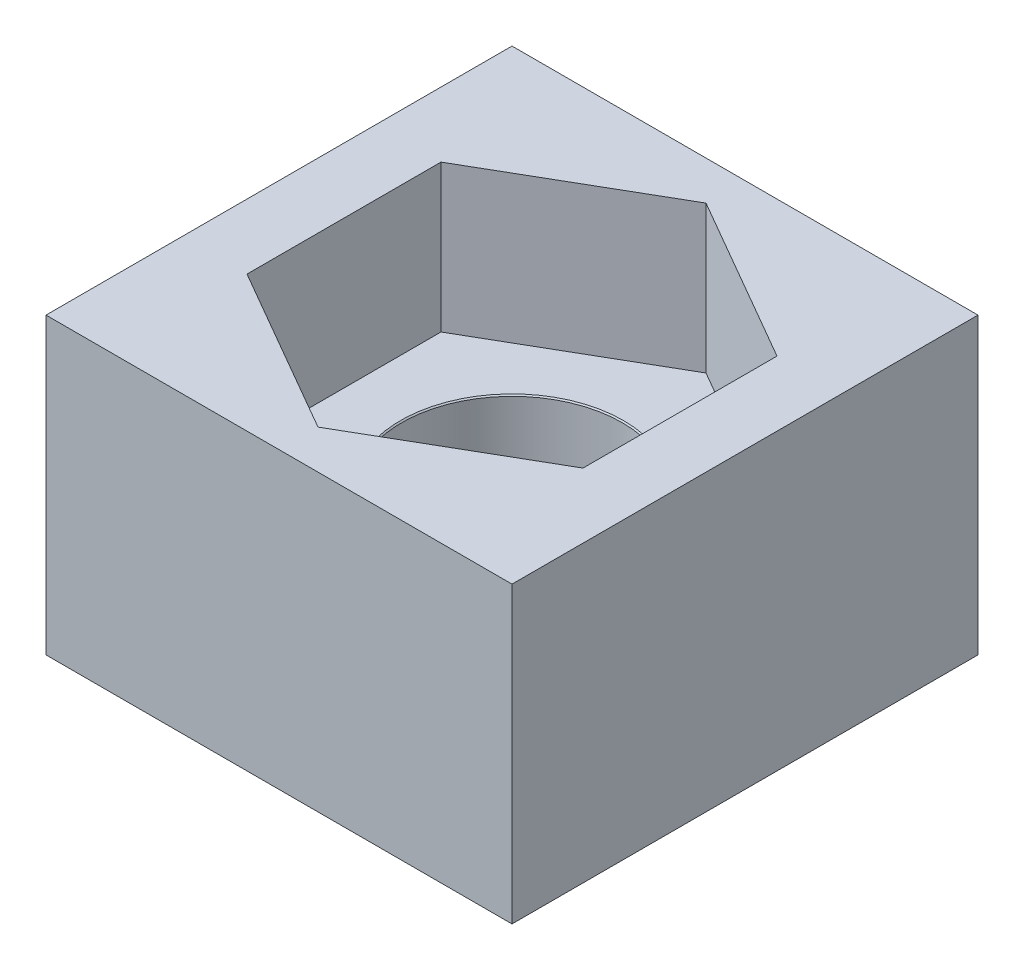
ISO-10303-21;
HEADER;
FILE_DESCRIPTION(('STEP AP214'),'2;1');
FILE_NAME('part.step','',(''),(''),'','','');
FILE_SCHEMA(('AUTOMOTIVE_DESIGN { 1 0 10303 214 1 1 1 1 }'));
ENDSEC;
DATA;
#1=APPLICATION_CONTEXT('core data for automotive mechanical design processes');
#2=APPLICATION_PROTOCOL_DEFINITION('international standard','automotive_design',2000,#1);
#3=PRODUCT_CONTEXT('',#1,'mechanical');
#4=PRODUCT('Part','Part','',(#3));
#5=PRODUCT_RELATED_PRODUCT_CATEGORY('part','',(#4));
#6=PRODUCT_DEFINITION_FORMATION('','',#4);
#7=PRODUCT_DEFINITION_CONTEXT('part definition',#1,'design');
#8=PRODUCT_DEFINITION('design','',#6,#7);
#9=PRODUCT_DEFINITION_SHAPE('','',#8);
#10=(LENGTH_UNIT() NAMED_UNIT(*) SI_UNIT(.MILLI.,.METRE.));
#11=(NAMED_UNIT(*) PLANE_ANGLE_UNIT() SI_UNIT($,.RADIAN.));
#12=(NAMED_UNIT(*) SI_UNIT($,.STERADIAN.) SOLID_ANGLE_UNIT());
#13=UNCERTAINTY_MEASURE_WITH_UNIT(LENGTH_MEASURE(1.E-05),#10,'distance_accuracy_value','');
#14=(GEOMETRIC_REPRESENTATION_CONTEXT(3) GLOBAL_UNCERTAINTY_ASSIGNED_CONTEXT((#13)) GLOBAL_UNIT_ASSIGNED_CONTEXT((#10,
#11,#12)) REPRESENTATION_CONTEXT('',''));
#15=CARTESIAN_POINT('',(0.,0.,0.));
#16=DIRECTION('',(0.,0.,1.));
#17=DIRECTION('',(1.,0.,0.));
#18=AXIS2_PLACEMENT_3D('',#15,#16,#17);
#19=CARTESIAN_POINT('',(4.75,6.,-4.75));
#20=DIRECTION('',(0.,0.,1.));
#21=DIRECTION('',(1.,0.,0.));
#22=AXIS2_PLACEMENT_3D('',#19,#20,#21);
#23=PLANE('',#22);
#24=DIRECTION('',(-1.,0.,0.));
#25=VECTOR('',#24,1.);
#26=CARTESIAN_POINT('',(4.75,0.,-4.75));
#27=LINE('',#26,#25);
#28=CARTESIAN_POINT('',(4.75,0.,-4.75));
#29=VERTEX_POINT('',#28);
#30=CARTESIAN_POINT('',(-4.75,0.,-4.75));
#31=VERTEX_POINT('',#30);
#32=EDGE_CURVE('E188',#29,#31,#27,.T.);
#33=ORIENTED_EDGE('',*,*,#32,.T.);
#34=DIRECTION('',(0.,-1.,0.));
#35=VECTOR('',#34,1.);
#36=CARTESIAN_POINT('',(-4.75,6.,-4.75));
#37=LINE('',#36,#35);
#38=CARTESIAN_POINT('',(-4.75,6.,-4.75));
#39=VERTEX_POINT('',#38);
#40=EDGE_CURVE('E11',#39,#31,#37,.T.);
#41=ORIENTED_EDGE('',*,*,#40,.F.);
#42=DIRECTION('',(-1.,0.,0.));
#43=VECTOR('',#42,1.);
#44=CARTESIAN_POINT('',(4.75,6.,-4.75));
#45=LINE('',#44,#43);
#46=CARTESIAN_POINT('',(4.75,6.,-4.75));
#47=VERTEX_POINT('',#46);
#48=EDGE_CURVE('E200',#47,#39,#45,.T.);
#49=ORIENTED_EDGE('',*,*,#48,.F.);
#50=DIRECTION('',(0.,-1.,0.));
#51=VECTOR('',#50,1.);
#52=CARTESIAN_POINT('',(4.75,6.,-4.75));
#53=LINE('',#52,#51);
#54=EDGE_CURVE('E63',#47,#29,#53,.T.);
#55=ORIENTED_EDGE('',*,*,#54,.T.);
#56=EDGE_LOOP('',(#33,#41,#49,#55));
#57=FACE_BOUND('',#56,.T.);
#58=ADVANCED_FACE('F39',(#57),#23,.F.);
#59=CARTESIAN_POINT('',(-4.75,6.,-4.75));
#60=DIRECTION('',(1.,0.,0.));
#61=DIRECTION('',(0.,0.,-1.));
#62=AXIS2_PLACEMENT_3D('',#59,#60,#61);
#63=PLANE('',#62);
#64=DIRECTION('',(0.,0.,1.));
#65=VECTOR('',#64,1.);
#66=CARTESIAN_POINT('',(-4.75,0.,-4.75));
#67=LINE('',#66,#65);
#68=CARTESIAN_POINT('',(-4.75,0.,4.75));
#69=VERTEX_POINT('',#68);
#70=EDGE_CURVE('E215',#31,#69,#67,.T.);
#71=ORIENTED_EDGE('',*,*,#70,.T.);
#72=DIRECTION('',(0.,-1.,0.));
#73=VECTOR('',#72,1.);
#74=CARTESIAN_POINT('',(-4.75,6.,4.75));
#75=LINE('',#74,#73);
#76=CARTESIAN_POINT('',(-4.75,6.,4.75));
#77=VERTEX_POINT('',#76);
#78=EDGE_CURVE('E47',#77,#69,#75,.T.);
#79=ORIENTED_EDGE('',*,*,#78,.F.);
#80=DIRECTION('',(0.,0.,1.));
#81=VECTOR('',#80,1.);
#82=CARTESIAN_POINT('',(-4.75,6.,-4.75));
#83=LINE('',#82,#81);
#84=EDGE_CURVE('E89',#39,#77,#83,.T.);
#85=ORIENTED_EDGE('',*,*,#84,.F.);
#86=ORIENTED_EDGE('',*,*,#40,.T.);
#87=EDGE_LOOP('',(#71,#79,#85,#86));
#88=FACE_BOUND('',#87,.T.);
#89=ADVANCED_FACE('F235',(#88),#63,.F.);
#90=CARTESIAN_POINT('',(4.75,6.,4.75));
#91=DIRECTION('',(0.,0.,1.));
#92=DIRECTION('',(1.,0.,0.));
#93=AXIS2_PLACEMENT_3D('',#90,#91,#92);
#94=PLANE('',#93);
#95=DIRECTION('',(-1.,0.,0.));
#96=VECTOR('',#95,1.);
#97=CARTESIAN_POINT('',(4.75,0.,4.75));
#98=LINE('',#97,#96);
#99=CARTESIAN_POINT('',(4.75,0.,4.75));
#100=VERTEX_POINT('',#99);
#101=EDGE_CURVE('E219',#100,#69,#98,.T.);
#102=ORIENTED_EDGE('',*,*,#101,.F.);
#103=DIRECTION('',(0.,-1.,0.));
#104=VECTOR('',#103,1.);
#105=CARTESIAN_POINT('',(4.75,6.,4.75));
#106=LINE('',#105,#104);
#107=CARTESIAN_POINT('',(4.75,6.,4.75));
#108=VERTEX_POINT('',#107);
#109=EDGE_CURVE('E228',#108,#100,#106,.T.);
#110=ORIENTED_EDGE('',*,*,#109,.F.);
#111=DIRECTION('',(-1.,0.,0.));
#112=VECTOR('',#111,1.);
#113=CARTESIAN_POINT('',(4.75,6.,4.75));
#114=LINE('',#113,#112);
#115=EDGE_CURVE('E206',#108,#77,#114,.T.);
#116=ORIENTED_EDGE('',*,*,#115,.T.);
#117=ORIENTED_EDGE('',*,*,#78,.T.);
#118=EDGE_LOOP('',(#102,#110,#116,#117));
#119=FACE_BOUND('',#118,.T.);
#120=ADVANCED_FACE('F233',(#119),#94,.T.);
#121=CARTESIAN_POINT('',(4.75,6.,-4.75));
#122=DIRECTION('',(1.,0.,0.));
#123=DIRECTION('',(0.,0.,-1.));
#124=AXIS2_PLACEMENT_3D('',#121,#122,#123);
#125=PLANE('',#124);
#126=DIRECTION('',(0.,0.,1.));
#127=VECTOR('',#126,1.);
#128=CARTESIAN_POINT('',(4.75,0.,-4.75));
#129=LINE('',#128,#127);
#130=EDGE_CURVE('E203',#29,#100,#129,.T.);
#131=ORIENTED_EDGE('',*,*,#130,.F.);
#132=ORIENTED_EDGE('',*,*,#54,.F.);
#133=DIRECTION('',(0.,0.,1.));
#134=VECTOR('',#133,1.);
#135=CARTESIAN_POINT('',(4.75,6.,-4.75));
#136=LINE('',#135,#134);
#137=EDGE_CURVE('E210',#47,#108,#136,.T.);
#138=ORIENTED_EDGE('',*,*,#137,.T.);
#139=ORIENTED_EDGE('',*,*,#109,.T.);
#140=EDGE_LOOP('',(#131,#132,#138,#139));
#141=FACE_BOUND('',#140,.T.);
#142=ADVANCED_FACE('F239',(#141),#125,.T.);
#143=CARTESIAN_POINT('',(0.,6.,0.));
#144=DIRECTION('',(0.,1.,0.));
#145=DIRECTION('',(0.,0.,1.));
#146=AXIS2_PLACEMENT_3D('',#143,#144,#145);
#147=PLANE('',#146);
#148=DIRECTION('',(0.866025403784439,0.,0.5));
#149=VECTOR('',#148,1.);
#150=CARTESIAN_POINT('',(-3.425,6.,1.97742467197447));
#151=LINE('',#150,#149);
#152=CARTESIAN_POINT('',(-3.425,6.,1.97742467197447));
#153=VERTEX_POINT('',#152);
#154=CARTESIAN_POINT('',(0.,6.,3.95484934394894));
#155=VERTEX_POINT('',#154);
#156=EDGE_CURVE('E54',#153,#155,#151,.T.);
#157=ORIENTED_EDGE('',*,*,#156,.F.);
#158=DIRECTION('',(0.,0.,1.));
#159=VECTOR('',#158,1.);
#160=CARTESIAN_POINT('',(-3.425,6.,-1.97742467197447));
#161=LINE('',#160,#159);
#162=CARTESIAN_POINT('',(-3.425,6.,-1.97742467197447));
#163=VERTEX_POINT('',#162);
#164=EDGE_CURVE('E148',#163,#153,#161,.T.);
#165=ORIENTED_EDGE('',*,*,#164,.F.);
#166=DIRECTION('',(-0.866025403784439,0.,0.5));
#167=VECTOR('',#166,1.);
#168=CARTESIAN_POINT('',(0.,6.,-3.95484934394894));
#169=LINE('',#168,#167);
#170=CARTESIAN_POINT('',(0.,6.,-3.95484934394894));
#171=VERTEX_POINT('',#170);
#172=EDGE_CURVE('E152',#171,#163,#169,.T.);
#173=ORIENTED_EDGE('',*,*,#172,.F.);
#174=DIRECTION('',(-0.866025403784439,0.,-0.5));
#175=VECTOR('',#174,1.);
#176=CARTESIAN_POINT('',(3.425,6.,-1.97742467197447));
#177=LINE('',#176,#175);
#178=CARTESIAN_POINT('',(3.425,6.,-1.97742467197447));
#179=VERTEX_POINT('',#178);
#180=EDGE_CURVE('E178',#179,#171,#177,.T.);
#181=ORIENTED_EDGE('',*,*,#180,.F.);
#182=DIRECTION('',(0.,0.,-1.));
#183=VECTOR('',#182,1.);
#184=CARTESIAN_POINT('',(3.425,6.,1.97742467197447));
#185=LINE('',#184,#183);
#186=CARTESIAN_POINT('',(3.425,6.,1.97742467197447));
#187=VERTEX_POINT('',#186);
#188=EDGE_CURVE('E174',#187,#179,#185,.T.);
#189=ORIENTED_EDGE('',*,*,#188,.F.);
#190=DIRECTION('',(0.866025403784439,0.,-0.5));
#191=VECTOR('',#190,1.);
#192=CARTESIAN_POINT('',(0.,6.,3.95484934394894));
#193=LINE('',#192,#191);
#194=EDGE_CURVE('E171',#155,#187,#193,.T.);
#195=ORIENTED_EDGE('',*,*,#194,.F.);
#196=EDGE_LOOP('',(#157,#165,#173,#181,#189,#195));
#197=FACE_BOUND('',#196,.T.);
#198=ORIENTED_EDGE('',*,*,#48,.T.);
#199=ORIENTED_EDGE('',*,*,#84,.T.);
#200=ORIENTED_EDGE('',*,*,#115,.F.);
#201=ORIENTED_EDGE('',*,*,#137,.F.);
#202=EDGE_LOOP('',(#198,#199,#200,#201));
#203=FACE_BOUND('',#202,.T.);
#204=ADVANCED_FACE('F242',(#197,#203),#147,.T.);
#205=CARTESIAN_POINT('',(0.,0.,0.));
#206=DIRECTION('',(0.,1.,0.));
#207=DIRECTION('',(0.,0.,1.));
#208=AXIS2_PLACEMENT_3D('',#205,#206,#207);
#209=PLANE('',#208);
#210=CARTESIAN_POINT('',(0.,0.,0.));
#211=DIRECTION('',(0.,1.,0.));
#212=DIRECTION('',(0.,0.,1.));
#213=AXIS2_PLACEMENT_3D('',#210,#211,#212);
#214=CIRCLE('',#213,2.25);
#215=CARTESIAN_POINT('',(0.,0.,2.25));
#216=VERTEX_POINT('',#215);
#217=EDGE_CURVE('E155',#216,#216,#214,.T.);
#218=ORIENTED_EDGE('',*,*,#217,.T.);
#219=EDGE_LOOP('',(#218));
#220=FACE_BOUND('',#219,.T.);
#221=ORIENTED_EDGE('',*,*,#32,.F.);
#222=ORIENTED_EDGE('',*,*,#130,.T.);
#223=ORIENTED_EDGE('',*,*,#101,.T.);
#224=ORIENTED_EDGE('',*,*,#70,.F.);
#225=EDGE_LOOP('',(#221,#222,#223,#224));
#226=FACE_BOUND('',#225,.T.);
#227=ADVANCED_FACE('F238',(#220,#226),#209,.F.);
#228=CARTESIAN_POINT('',(-3.425,3.,1.97742467197447));
#229=DIRECTION('',(-0.5,0.,0.866025403784439));
#230=DIRECTION('',(0.866025403784439,0.,0.5));
#231=AXIS2_PLACEMENT_3D('',#228,#229,#230);
#232=PLANE('',#231);
#233=ORIENTED_EDGE('',*,*,#156,.T.);
#234=DIRECTION('',(0.,1.,0.));
#235=VECTOR('',#234,1.);
#236=CARTESIAN_POINT('',(0.,3.,3.95484934394894));
#237=LINE('',#236,#235);
#238=CARTESIAN_POINT('',(0.,3.,3.95484934394894));
#239=VERTEX_POINT('',#238);
#240=EDGE_CURVE('E122',#239,#155,#237,.T.);
#241=ORIENTED_EDGE('',*,*,#240,.F.);
#242=DIRECTION('',(0.866025403784439,0.,0.5));
#243=VECTOR('',#242,1.);
#244=CARTESIAN_POINT('',(-3.425,3.,1.97742467197447));
#245=LINE('',#244,#243);
#246=CARTESIAN_POINT('',(-3.425,3.,1.97742467197447));
#247=VERTEX_POINT('',#246);
#248=EDGE_CURVE('E126',#247,#239,#245,.T.);
#249=ORIENTED_EDGE('',*,*,#248,.F.);
#250=DIRECTION('',(0.,1.,0.));
#251=VECTOR('',#250,1.);
#252=CARTESIAN_POINT('',(-3.425,3.,1.97742467197447));
#253=LINE('',#252,#251);
#254=EDGE_CURVE('E185',#247,#153,#253,.T.);
#255=ORIENTED_EDGE('',*,*,#254,.T.);
#256=EDGE_LOOP('',(#233,#241,#249,#255));
#257=FACE_BOUND('',#256,.T.);
#258=ADVANCED_FACE('F124',(#257),#232,.F.);
#259=CARTESIAN_POINT('',(-3.425,3.,-1.97742467197447));
#260=DIRECTION('',(-1.,0.,0.));
#261=DIRECTION('',(0.,0.,1.));
#262=AXIS2_PLACEMENT_3D('',#259,#260,#261);
#263=PLANE('',#262);
#264=ORIENTED_EDGE('',*,*,#164,.T.);
#265=ORIENTED_EDGE('',*,*,#254,.F.);
#266=DIRECTION('',(0.,0.,1.));
#267=VECTOR('',#266,1.);
#268=CARTESIAN_POINT('',(-3.425,3.,-1.97742467197447));
#269=LINE('',#268,#267);
#270=CARTESIAN_POINT('',(-3.425,3.,-1.97742467197447));
#271=VERTEX_POINT('',#270);
#272=EDGE_CURVE('E133',#271,#247,#269,.T.);
#273=ORIENTED_EDGE('',*,*,#272,.F.);
#274=DIRECTION('',(0.,1.,0.));
#275=VECTOR('',#274,1.);
#276=CARTESIAN_POINT('',(-3.425,3.,-1.97742467197447));
#277=LINE('',#276,#275);
#278=EDGE_CURVE('E189',#271,#163,#277,.T.);
#279=ORIENTED_EDGE('',*,*,#278,.T.);
#280=EDGE_LOOP('',(#264,#265,#273,#279));
#281=FACE_BOUND('',#280,.T.);
#282=ADVANCED_FACE('F262',(#281),#263,.F.);
#283=CARTESIAN_POINT('',(0.,3.,-3.95484934394894));
#284=DIRECTION('',(-0.5,0.,-0.866025403784439));
#285=DIRECTION('',(-0.866025403784439,0.,0.5));
#286=AXIS2_PLACEMENT_3D('',#283,#284,#285);
#287=PLANE('',#286);
#288=ORIENTED_EDGE('',*,*,#172,.T.);
#289=ORIENTED_EDGE('',*,*,#278,.F.);
#290=DIRECTION('',(-0.866025403784439,0.,0.5));
#291=VECTOR('',#290,1.);
#292=CARTESIAN_POINT('',(0.,3.,-3.95484934394894));
#293=LINE('',#292,#291);
#294=CARTESIAN_POINT('',(0.,3.,-3.95484934394894));
#295=VERTEX_POINT('',#294);
#296=EDGE_CURVE('E164',#295,#271,#293,.T.);
#297=ORIENTED_EDGE('',*,*,#296,.F.);
#298=DIRECTION('',(0.,1.,0.));
#299=VECTOR('',#298,1.);
#300=CARTESIAN_POINT('',(0.,3.,-3.95484934394894));
#301=LINE('',#300,#299);
#302=EDGE_CURVE('E192',#295,#171,#301,.T.);
#303=ORIENTED_EDGE('',*,*,#302,.T.);
#304=EDGE_LOOP('',(#288,#289,#297,#303));
#305=FACE_BOUND('',#304,.T.);
#306=ADVANCED_FACE('F272',(#305),#287,.F.);
#307=CARTESIAN_POINT('',(3.425,3.,-1.97742467197447));
#308=DIRECTION('',(0.5,0.,-0.866025403784439));
#309=DIRECTION('',(-0.866025403784439,0.,-0.5));
#310=AXIS2_PLACEMENT_3D('',#307,#308,#309);
#311=PLANE('',#310);
#312=ORIENTED_EDGE('',*,*,#180,.T.);
#313=ORIENTED_EDGE('',*,*,#302,.F.);
#314=DIRECTION('',(-0.866025403784439,0.,-0.5));
#315=VECTOR('',#314,1.);
#316=CARTESIAN_POINT('',(3.425,3.,-1.97742467197447));
#317=LINE('',#316,#315);
#318=CARTESIAN_POINT('',(3.425,3.,-1.97742467197447));
#319=VERTEX_POINT('',#318);
#320=EDGE_CURVE('E160',#319,#295,#317,.T.);
#321=ORIENTED_EDGE('',*,*,#320,.F.);
#322=DIRECTION('',(0.,1.,0.));
#323=VECTOR('',#322,1.);
#324=CARTESIAN_POINT('',(3.425,3.,-1.97742467197447));
#325=LINE('',#324,#323);
#326=EDGE_CURVE('E195',#319,#179,#325,.T.);
#327=ORIENTED_EDGE('',*,*,#326,.T.);
#328=EDGE_LOOP('',(#312,#313,#321,#327));
#329=FACE_BOUND('',#328,.T.);
#330=ADVANCED_FACE('F268',(#329),#311,.F.);
#331=CARTESIAN_POINT('',(3.425,3.,1.97742467197447));
#332=DIRECTION('',(1.,0.,0.));
#333=DIRECTION('',(0.,0.,-1.));
#334=AXIS2_PLACEMENT_3D('',#331,#332,#333);
#335=PLANE('',#334);
#336=ORIENTED_EDGE('',*,*,#188,.T.);
#337=ORIENTED_EDGE('',*,*,#326,.F.);
#338=DIRECTION('',(0.,0.,-1.));
#339=VECTOR('',#338,1.);
#340=CARTESIAN_POINT('',(3.425,3.,1.97742467197447));
#341=LINE('',#340,#339);
#342=CARTESIAN_POINT('',(3.425,3.,1.97742467197447));
#343=VERTEX_POINT('',#342);
#344=EDGE_CURVE('E142',#343,#319,#341,.T.);
#345=ORIENTED_EDGE('',*,*,#344,.F.);
#346=DIRECTION('',(0.,1.,0.));
#347=VECTOR('',#346,1.);
#348=CARTESIAN_POINT('',(3.425,3.,1.97742467197447));
#349=LINE('',#348,#347);
#350=EDGE_CURVE('E132',#343,#187,#349,.T.);
#351=ORIENTED_EDGE('',*,*,#350,.T.);
#352=EDGE_LOOP('',(#336,#337,#345,#351));
#353=FACE_BOUND('',#352,.T.);
#354=ADVANCED_FACE('F265',(#353),#335,.F.);
#355=CARTESIAN_POINT('',(0.,3.,3.95484934394894));
#356=DIRECTION('',(0.5,0.,0.866025403784439));
#357=DIRECTION('',(0.866025403784439,0.,-0.5));
#358=AXIS2_PLACEMENT_3D('',#355,#356,#357);
#359=PLANE('',#358);
#360=ORIENTED_EDGE('',*,*,#194,.T.);
#361=ORIENTED_EDGE('',*,*,#350,.F.);
#362=DIRECTION('',(0.866025403784439,0.,-0.5));
#363=VECTOR('',#362,1.);
#364=CARTESIAN_POINT('',(0.,3.,3.95484934394894));
#365=LINE('',#364,#363);
#366=EDGE_CURVE('E136',#239,#343,#365,.T.);
#367=ORIENTED_EDGE('',*,*,#366,.F.);
#368=ORIENTED_EDGE('',*,*,#240,.T.);
#369=EDGE_LOOP('',(#360,#361,#367,#368));
#370=FACE_BOUND('',#369,.T.);
#371=ADVANCED_FACE('F137',(#370),#359,.F.);
#372=CARTESIAN_POINT('',(0.,3.,0.));
#373=DIRECTION('',(0.,1.,0.));
#374=DIRECTION('',(0.,0.,1.));
#375=AXIS2_PLACEMENT_3D('',#372,#373,#374);
#376=PLANE('',#375);
#377=CARTESIAN_POINT('',(0.,3.,0.));
#378=DIRECTION('',(0.,1.,0.));
#379=DIRECTION('',(0.,0.,1.));
#380=AXIS2_PLACEMENT_3D('',#377,#378,#379);
#381=CIRCLE('',#380,2.275);
#382=CARTESIAN_POINT('',(0.,3.,2.275));
#383=VERTEX_POINT('',#382);
#384=EDGE_CURVE('E298',#383,#383,#381,.T.);
#385=ORIENTED_EDGE('',*,*,#384,.F.);
#386=EDGE_LOOP('',(#385));
#387=FACE_BOUND('',#386,.T.);
#388=ORIENTED_EDGE('',*,*,#248,.T.);
#389=ORIENTED_EDGE('',*,*,#366,.T.);
#390=ORIENTED_EDGE('',*,*,#344,.T.);
#391=ORIENTED_EDGE('',*,*,#320,.T.);
#392=ORIENTED_EDGE('',*,*,#296,.T.);
#393=ORIENTED_EDGE('',*,*,#272,.T.);
#394=EDGE_LOOP('',(#388,#389,#390,#391,#392,#393));
#395=FACE_BOUND('',#394,.T.);
#396=ADVANCED_FACE('F144',(#387,#395),#376,.T.);
#397=CARTESIAN_POINT('',(0.,3.,0.));
#398=DIRECTION('',(0.,1.,0.));
#399=DIRECTION('',(0.,0.,1.));
#400=AXIS2_PLACEMENT_3D('',#397,#398,#399);
#401=CYLINDRICAL_SURFACE('',#400,2.25);
#402=ORIENTED_EDGE('',*,*,#217,.F.);
#403=EDGE_LOOP('',(#402));
#404=FACE_BOUND('',#403,.T.);
#405=CARTESIAN_POINT('',(0.,2.975,0.));
#406=DIRECTION('',(0.,1.,0.));
#407=DIRECTION('',(0.,0.,1.));
#408=AXIS2_PLACEMENT_3D('',#405,#406,#407);
#409=CIRCLE('',#408,2.25);
#410=CARTESIAN_POINT('',(0.,2.975,2.25));
#411=VERTEX_POINT('',#410);
#412=EDGE_CURVE('E295',#411,#411,#409,.T.);
#413=ORIENTED_EDGE('',*,*,#412,.T.);
#414=EDGE_LOOP('',(#413));
#415=FACE_BOUND('',#414,.T.);
#416=ADVANCED_FACE('F282',(#404,#415),#401,.F.);
#417=CARTESIAN_POINT('',(0.,3.,0.));
#418=DIRECTION('',(0.,1.,0.));
#419=DIRECTION('',(0.,0.,1.));
#420=AXIS2_PLACEMENT_3D('',#417,#418,#419);
#421=CONICAL_SURFACE('',#420,2.275,0.785398163397483);
#422=ORIENTED_EDGE('',*,*,#412,.F.);
#423=EDGE_LOOP('',(#422));
#424=FACE_BOUND('',#423,.T.);
#425=ORIENTED_EDGE('',*,*,#384,.T.);
#426=EDGE_LOOP('',(#425));
#427=FACE_BOUND('',#426,.T.);
#428=ADVANCED_FACE('F286',(#424,#427),#421,.F.);
#429=CLOSED_SHELL('',(#58,#89,#120,#142,#204,#227,#258,#282,#306,#330,#354,#371,#396,#416,#428));
#430=MANIFOLD_SOLID_BREP('B2',#429);
#431=ADVANCED_BREP_SHAPE_REPRESENTATION('',(#18,#430),#14);
#432=SHAPE_DEFINITION_REPRESENTATION(#9,#431);
ENDSEC;
END-ISO-10303-21;
